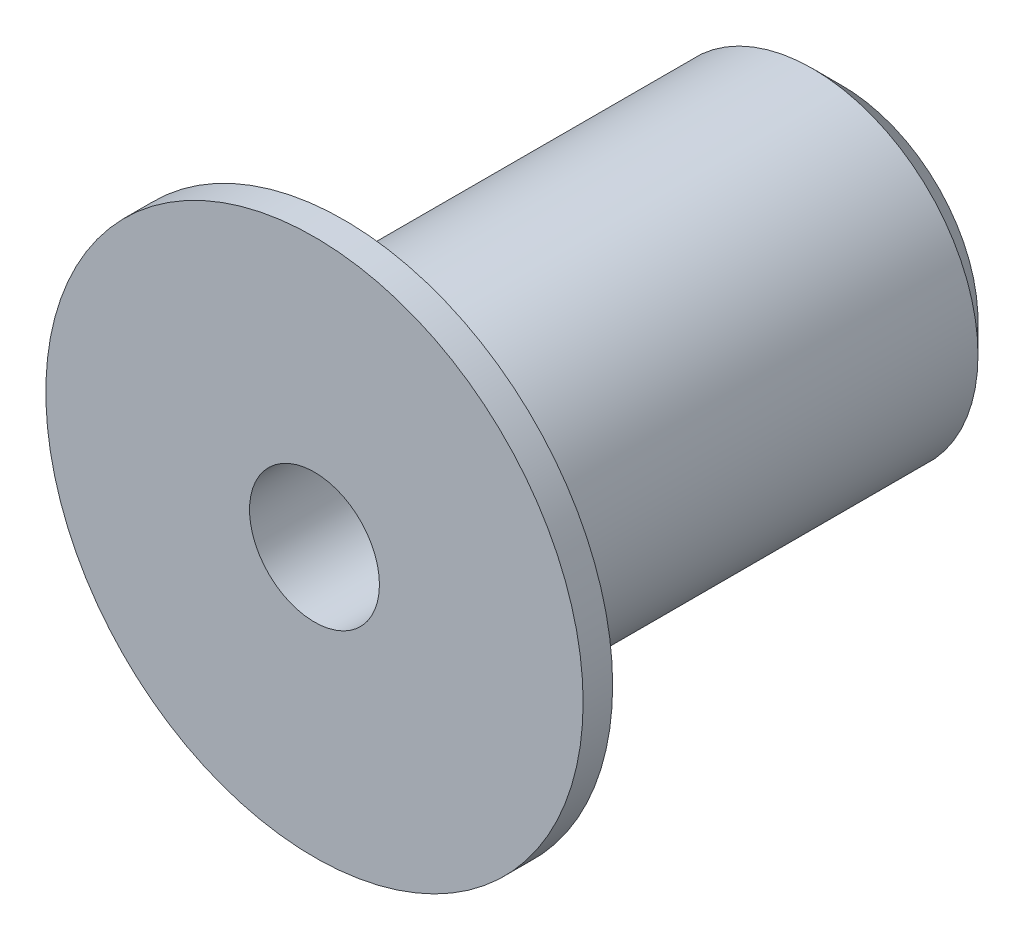
ISO-10303-21;
HEADER;
FILE_DESCRIPTION(('STEP AP214'),'2;1');
FILE_NAME('part.step','',(''),(''),'','','');
FILE_SCHEMA(('AUTOMOTIVE_DESIGN { 1 0 10303 214 1 1 1 1 }'));
ENDSEC;
DATA;
#1=APPLICATION_CONTEXT('core data for automotive mechanical design processes');
#2=APPLICATION_PROTOCOL_DEFINITION('international standard','automotive_design',2000,#1);
#3=PRODUCT_CONTEXT('',#1,'mechanical');
#4=PRODUCT('Part','Part','',(#3));
#5=PRODUCT_RELATED_PRODUCT_CATEGORY('part','',(#4));
#6=PRODUCT_DEFINITION_FORMATION('','',#4);
#7=PRODUCT_DEFINITION_CONTEXT('part definition',#1,'design');
#8=PRODUCT_DEFINITION('design','',#6,#7);
#9=PRODUCT_DEFINITION_SHAPE('','',#8);
#10=(LENGTH_UNIT() NAMED_UNIT(*) SI_UNIT(.MILLI.,.METRE.));
#11=(NAMED_UNIT(*) PLANE_ANGLE_UNIT() SI_UNIT($,.RADIAN.));
#12=(NAMED_UNIT(*) SI_UNIT($,.STERADIAN.) SOLID_ANGLE_UNIT());
#13=UNCERTAINTY_MEASURE_WITH_UNIT(LENGTH_MEASURE(1.E-05),#10,'distance_accuracy_value','');
#14=(GEOMETRIC_REPRESENTATION_CONTEXT(3) GLOBAL_UNCERTAINTY_ASSIGNED_CONTEXT((#13)) GLOBAL_UNIT_ASSIGNED_CONTEXT((#10,
#11,#12)) REPRESENTATION_CONTEXT('',''));
#15=CARTESIAN_POINT('',(0.,0.,0.));
#16=DIRECTION('',(0.,0.,1.));
#17=DIRECTION('',(1.,0.,0.));
#18=AXIS2_PLACEMENT_3D('',#15,#16,#17);
#19=CARTESIAN_POINT('',(0.,19.55,470.158968248641));
#20=DIRECTION('',(0.,0.,1.));
#21=DIRECTION('',(1.,0.,0.));
#22=AXIS2_PLACEMENT_3D('',#19,#20,#21);
#23=CYLINDRICAL_SURFACE('',#22,2.79999999999999);
#24=CARTESIAN_POINT('',(0.,19.55,461.721468248641));
#25=DIRECTION('',(0.,0.,-1.));
#26=DIRECTION('',(-1.,0.,0.));
#27=AXIS2_PLACEMENT_3D('',#24,#25,#26);
#28=CIRCLE('',#27,2.79999999999999);
#29=CARTESIAN_POINT('',(-2.79999999999999,19.55,461.721468248641));
#30=VERTEX_POINT('',#29);
#31=EDGE_CURVE('E43',#30,#30,#28,.F.);
#32=ORIENTED_EDGE('',*,*,#31,.T.);
#33=EDGE_LOOP('',(#32));
#34=FACE_BOUND('',#33,.T.);
#35=CARTESIAN_POINT('',(0.,19.55,469.158968248641));
#36=DIRECTION('',(0.,0.,1.));
#37=DIRECTION('',(1.,0.,0.));
#38=AXIS2_PLACEMENT_3D('',#35,#36,#37);
#39=CIRCLE('',#38,2.79999999999999);
#40=CARTESIAN_POINT('',(2.79999999999999,19.55,469.158968248641));
#41=VERTEX_POINT('',#40);
#42=EDGE_CURVE('E47',#41,#41,#39,.T.);
#43=ORIENTED_EDGE('',*,*,#42,.F.);
#44=EDGE_LOOP('',(#43));
#45=FACE_BOUND('',#44,.T.);
#46=ADVANCED_FACE('F35',(#34,#45),#23,.T.);
#47=CARTESIAN_POINT('',(0.,19.55,469.658968248641));
#48=DIRECTION('',(0.,0.,1.));
#49=DIRECTION('',(1.,0.,0.));
#50=AXIS2_PLACEMENT_3D('',#47,#48,#49);
#51=CONICAL_SURFACE('',#50,4.55,1.29249666778979);
#52=ORIENTED_EDGE('',*,*,#42,.T.);
#53=EDGE_LOOP('',(#52));
#54=FACE_BOUND('',#53,.T.);
#55=CARTESIAN_POINT('',(0.,19.55,469.658968248641));
#56=DIRECTION('',(0.,0.,1.));
#57=DIRECTION('',(1.,0.,0.));
#58=AXIS2_PLACEMENT_3D('',#55,#56,#57);
#59=CIRCLE('',#58,4.55);
#60=CARTESIAN_POINT('',(4.55,19.55,469.658968248641));
#61=VERTEX_POINT('',#60);
#62=EDGE_CURVE('E51',#61,#61,#59,.T.);
#63=ORIENTED_EDGE('',*,*,#62,.F.);
#64=EDGE_LOOP('',(#63));
#65=FACE_BOUND('',#64,.T.);
#66=ADVANCED_FACE('F82',(#54,#65),#51,.T.);
#67=CARTESIAN_POINT('',(0.,19.55,470.158968248641));
#68=DIRECTION('',(0.,0.,1.));
#69=DIRECTION('',(1.,0.,0.));
#70=AXIS2_PLACEMENT_3D('',#67,#68,#69);
#71=CYLINDRICAL_SURFACE('',#70,4.55);
#72=ORIENTED_EDGE('',*,*,#62,.T.);
#73=EDGE_LOOP('',(#72));
#74=FACE_BOUND('',#73,.T.);
#75=CARTESIAN_POINT('',(0.,19.55,470.158968248641));
#76=DIRECTION('',(0.,0.,1.));
#77=DIRECTION('',(1.,0.,0.));
#78=AXIS2_PLACEMENT_3D('',#75,#76,#77);
#79=CIRCLE('',#78,4.55);
#80=CARTESIAN_POINT('',(4.55,19.55,470.158968248641));
#81=VERTEX_POINT('',#80);
#82=EDGE_CURVE('E56',#81,#81,#79,.T.);
#83=ORIENTED_EDGE('',*,*,#82,.F.);
#84=EDGE_LOOP('',(#83));
#85=FACE_BOUND('',#84,.T.);
#86=ADVANCED_FACE('F76',(#74,#85),#71,.T.);
#87=CARTESIAN_POINT('',(0.,0.,470.158968248641));
#88=DIRECTION('',(0.,0.,1.));
#89=DIRECTION('',(1.,0.,0.));
#90=AXIS2_PLACEMENT_3D('',#87,#88,#89);
#91=PLANE('',#90);
#92=ORIENTED_EDGE('',*,*,#82,.T.);
#93=EDGE_LOOP('',(#92));
#94=FACE_BOUND('',#93,.T.);
#95=CARTESIAN_POINT('',(0.,19.55,470.158968248641));
#96=DIRECTION('',(0.,0.,1.));
#97=DIRECTION('',(1.,0.,0.));
#98=AXIS2_PLACEMENT_3D('',#95,#96,#97);
#99=CIRCLE('',#98,1.09999999999999);
#100=CARTESIAN_POINT('',(1.09999999999999,19.55,470.158968248641));
#101=VERTEX_POINT('',#100);
#102=EDGE_CURVE('E59',#101,#101,#99,.T.);
#103=ORIENTED_EDGE('',*,*,#102,.F.);
#104=EDGE_LOOP('',(#103));
#105=FACE_BOUND('',#104,.T.);
#106=ADVANCED_FACE('F71',(#94,#105),#91,.T.);
#107=CARTESIAN_POINT('',(0.,19.55,470.158968248641));
#108=DIRECTION('',(0.,0.,1.));
#109=DIRECTION('',(1.,0.,0.));
#110=AXIS2_PLACEMENT_3D('',#107,#108,#109);
#111=CYLINDRICAL_SURFACE('',#110,1.09999999999999);
#112=CARTESIAN_POINT('',(0.,19.55,461.221468248641));
#113=DIRECTION('',(0.,0.,1.));
#114=DIRECTION('',(1.,0.,0.));
#115=AXIS2_PLACEMENT_3D('',#112,#113,#114);
#116=CIRCLE('',#115,1.09999999999999);
#117=CARTESIAN_POINT('',(1.09999999999999,19.55,461.221468248641));
#118=VERTEX_POINT('',#117);
#119=EDGE_CURVE('E62',#118,#118,#116,.T.);
#120=ORIENTED_EDGE('',*,*,#119,.F.);
#121=EDGE_LOOP('',(#120));
#122=FACE_BOUND('',#121,.T.);
#123=ORIENTED_EDGE('',*,*,#102,.T.);
#124=EDGE_LOOP('',(#123));
#125=FACE_BOUND('',#124,.T.);
#126=ADVANCED_FACE('F68',(#122,#125),#111,.F.);
#127=CARTESIAN_POINT('',(0.,0.,461.221468248641));
#128=DIRECTION('',(0.,0.,-1.));
#129=DIRECTION('',(-1.,0.,0.));
#130=AXIS2_PLACEMENT_3D('',#127,#128,#129);
#131=PLANE('',#130);
#132=CARTESIAN_POINT('',(0.,19.55,461.221468248641));
#133=DIRECTION('',(0.,0.,-1.));
#134=DIRECTION('',(-1.,0.,0.));
#135=AXIS2_PLACEMENT_3D('',#132,#133,#134);
#136=CIRCLE('',#135,2.29999999999997);
#137=CARTESIAN_POINT('',(-2.29999999999997,19.55,461.221468248641));
#138=VERTEX_POINT('',#137);
#139=EDGE_CURVE('E10',#138,#138,#136,.T.);
#140=ORIENTED_EDGE('',*,*,#139,.T.);
#141=EDGE_LOOP('',(#140));
#142=FACE_BOUND('',#141,.T.);
#143=ORIENTED_EDGE('',*,*,#119,.T.);
#144=EDGE_LOOP('',(#143));
#145=FACE_BOUND('',#144,.T.);
#146=ADVANCED_FACE('F66',(#142,#145),#131,.T.);
#147=CARTESIAN_POINT('',(0.,19.55,461.721468248641));
#148=DIRECTION('',(0.,0.,1.));
#149=DIRECTION('',(1.,0.,0.));
#150=AXIS2_PLACEMENT_3D('',#147,#148,#149);
#151=CONICAL_SURFACE('',#150,2.79999999999999,0.78539816339741);
#152=ORIENTED_EDGE('',*,*,#139,.F.);
#153=EDGE_LOOP('',(#152));
#154=FACE_BOUND('',#153,.T.);
#155=ORIENTED_EDGE('',*,*,#31,.F.);
#156=EDGE_LOOP('',(#155));
#157=FACE_BOUND('',#156,.T.);
#158=ADVANCED_FACE('F38',(#154,#157),#151,.T.);
#159=CLOSED_SHELL('',(#46,#66,#86,#106,#126,#146,#158));
#160=MANIFOLD_SOLID_BREP('B2',#159);
#161=ADVANCED_BREP_SHAPE_REPRESENTATION('',(#18,#160),#14);
#162=SHAPE_DEFINITION_REPRESENTATION(#9,#161);
ENDSEC;
END-ISO-10303-21;
